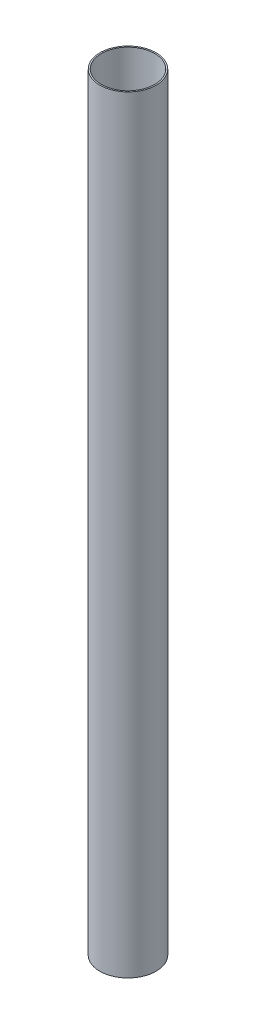
ISO-10303-21;
HEADER;
FILE_DESCRIPTION(('STEP AP214'),'2;1');
FILE_NAME('part.step','',(''),(''),'','','');
FILE_SCHEMA(('AUTOMOTIVE_DESIGN { 1 0 10303 214 1 1 1 1 }'));
ENDSEC;
DATA;
#1=APPLICATION_CONTEXT('core data for automotive mechanical design processes');
#2=APPLICATION_PROTOCOL_DEFINITION('international standard','automotive_design',2000,#1);
#3=PRODUCT_CONTEXT('',#1,'mechanical');
#4=PRODUCT('Part','Part','',(#3));
#5=PRODUCT_RELATED_PRODUCT_CATEGORY('part','',(#4));
#6=PRODUCT_DEFINITION_FORMATION('','',#4);
#7=PRODUCT_DEFINITION_CONTEXT('part definition',#1,'design');
#8=PRODUCT_DEFINITION('design','',#6,#7);
#9=PRODUCT_DEFINITION_SHAPE('','',#8);
#10=(LENGTH_UNIT() NAMED_UNIT(*) SI_UNIT(.MILLI.,.METRE.));
#11=(NAMED_UNIT(*) PLANE_ANGLE_UNIT() SI_UNIT($,.RADIAN.));
#12=(NAMED_UNIT(*) SI_UNIT($,.STERADIAN.) SOLID_ANGLE_UNIT());
#13=UNCERTAINTY_MEASURE_WITH_UNIT(LENGTH_MEASURE(1.E-05),#10,'distance_accuracy_value','');
#14=(GEOMETRIC_REPRESENTATION_CONTEXT(3) GLOBAL_UNCERTAINTY_ASSIGNED_CONTEXT((#13)) GLOBAL_UNIT_ASSIGNED_CONTEXT((#10,
#11,#12)) REPRESENTATION_CONTEXT('',''));
#15=CARTESIAN_POINT('',(0.,0.,0.));
#16=DIRECTION('',(0.,0.,1.));
#17=DIRECTION('',(1.,0.,0.));
#18=AXIS2_PLACEMENT_3D('',#15,#16,#17);
#19=CARTESIAN_POINT('',(0.,1500.,0.));
#20=DIRECTION('',(0.,1.,0.));
#21=DIRECTION('',(0.,0.,1.));
#22=AXIS2_PLACEMENT_3D('',#19,#20,#21);
#23=PLANE('',#22);
#24=CARTESIAN_POINT('',(0.,1500.,0.));
#25=DIRECTION('',(0.,1.,0.));
#26=DIRECTION('',(0.,0.,1.));
#27=AXIS2_PLACEMENT_3D('',#24,#25,#26);
#28=CIRCLE('',#27,55.);
#29=CARTESIAN_POINT('',(0.,1500.,55.));
#30=VERTEX_POINT('',#29);
#31=EDGE_CURVE('E11',#30,#30,#28,.T.);
#32=ORIENTED_EDGE('',*,*,#31,.T.);
#33=EDGE_LOOP('',(#32));
#34=FACE_BOUND('',#33,.T.);
#35=CARTESIAN_POINT('',(0.,1500.,0.));
#36=DIRECTION('',(0.,1.,0.));
#37=DIRECTION('',(1.,0.,0.));
#38=AXIS2_PLACEMENT_3D('',#35,#36,#37);
#39=CIRCLE('',#38,52.3);
#40=CARTESIAN_POINT('',(52.3,1500.,0.));
#41=VERTEX_POINT('',#40);
#42=EDGE_CURVE('E50',#41,#41,#39,.T.);
#43=ORIENTED_EDGE('',*,*,#42,.F.);
#44=EDGE_LOOP('',(#43));
#45=FACE_BOUND('',#44,.T.);
#46=ADVANCED_FACE('F39',(#34,#45),#23,.T.);
#47=CARTESIAN_POINT('',(0.,0.,0.));
#48=DIRECTION('',(0.,1.,0.));
#49=DIRECTION('',(0.,0.,1.));
#50=AXIS2_PLACEMENT_3D('',#47,#48,#49);
#51=PLANE('',#50);
#52=CARTESIAN_POINT('',(0.,0.,0.));
#53=DIRECTION('',(0.,1.,0.));
#54=DIRECTION('',(0.,0.,1.));
#55=AXIS2_PLACEMENT_3D('',#52,#53,#54);
#56=CIRCLE('',#55,55.);
#57=CARTESIAN_POINT('',(0.,0.,55.));
#58=VERTEX_POINT('',#57);
#59=EDGE_CURVE('E43',#58,#58,#56,.T.);
#60=ORIENTED_EDGE('',*,*,#59,.F.);
#61=EDGE_LOOP('',(#60));
#62=FACE_BOUND('',#61,.T.);
#63=CARTESIAN_POINT('',(0.,0.,0.));
#64=DIRECTION('',(0.,1.,0.));
#65=DIRECTION('',(1.,0.,0.));
#66=AXIS2_PLACEMENT_3D('',#63,#64,#65);
#67=CIRCLE('',#66,52.3);
#68=CARTESIAN_POINT('',(52.3,0.,0.));
#69=VERTEX_POINT('',#68);
#70=EDGE_CURVE('E52',#69,#69,#67,.T.);
#71=ORIENTED_EDGE('',*,*,#70,.T.);
#72=EDGE_LOOP('',(#71));
#73=FACE_BOUND('',#72,.T.);
#74=ADVANCED_FACE('F62',(#62,#73),#51,.F.);
#75=CARTESIAN_POINT('',(0.,1500.,0.));
#76=DIRECTION('',(0.,-1.,0.));
#77=DIRECTION('',(0.,0.,-1.));
#78=AXIS2_PLACEMENT_3D('',#75,#76,#77);
#79=CYLINDRICAL_SURFACE('',#78,55.);
#80=ORIENTED_EDGE('',*,*,#31,.F.);
#81=EDGE_LOOP('',(#80));
#82=FACE_BOUND('',#81,.T.);
#83=ORIENTED_EDGE('',*,*,#59,.T.);
#84=EDGE_LOOP('',(#83));
#85=FACE_BOUND('',#84,.T.);
#86=ADVANCED_FACE('F41',(#82,#85),#79,.T.);
#87=CARTESIAN_POINT('',(0.,1500.,0.));
#88=DIRECTION('',(0.,-1.,0.));
#89=DIRECTION('',(0.,0.,-1.));
#90=AXIS2_PLACEMENT_3D('',#87,#88,#89);
#91=CYLINDRICAL_SURFACE('',#90,52.3);
#92=ORIENTED_EDGE('',*,*,#42,.T.);
#93=EDGE_LOOP('',(#92));
#94=FACE_BOUND('',#93,.T.);
#95=ORIENTED_EDGE('',*,*,#70,.F.);
#96=EDGE_LOOP('',(#95));
#97=FACE_BOUND('',#96,.T.);
#98=ADVANCED_FACE('F58',(#94,#97),#91,.F.);
#99=CLOSED_SHELL('',(#46,#74,#86,#98));
#100=MANIFOLD_SOLID_BREP('B2',#99);
#101=ADVANCED_BREP_SHAPE_REPRESENTATION('',(#18,#100),#14);
#102=SHAPE_DEFINITION_REPRESENTATION(#9,#101);
ENDSEC;
END-ISO-10303-21;
